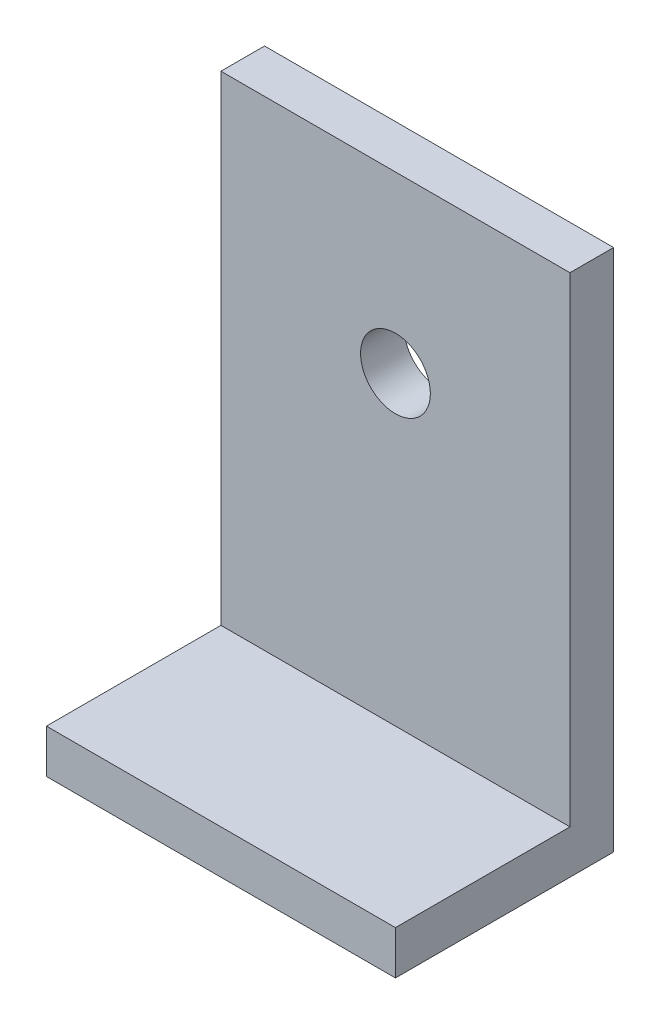
ISO-10303-21;
HEADER;
FILE_DESCRIPTION(('STEP AP214'),'2;1');
FILE_NAME('part.step','',(''),(''),'','','');
FILE_SCHEMA(('AUTOMOTIVE_DESIGN { 1 0 10303 214 1 1 1 1 }'));
ENDSEC;
DATA;
#1=APPLICATION_CONTEXT('core data for automotive mechanical design processes');
#2=APPLICATION_PROTOCOL_DEFINITION('international standard','automotive_design',2000,#1);
#3=PRODUCT_CONTEXT('',#1,'mechanical');
#4=PRODUCT('Part','Part','',(#3));
#5=PRODUCT_RELATED_PRODUCT_CATEGORY('part','',(#4));
#6=PRODUCT_DEFINITION_FORMATION('','',#4);
#7=PRODUCT_DEFINITION_CONTEXT('part definition',#1,'design');
#8=PRODUCT_DEFINITION('design','',#6,#7);
#9=PRODUCT_DEFINITION_SHAPE('','',#8);
#10=(LENGTH_UNIT() NAMED_UNIT(*) SI_UNIT(.MILLI.,.METRE.));
#11=(NAMED_UNIT(*) PLANE_ANGLE_UNIT() SI_UNIT($,.RADIAN.));
#12=(NAMED_UNIT(*) SI_UNIT($,.STERADIAN.) SOLID_ANGLE_UNIT());
#13=UNCERTAINTY_MEASURE_WITH_UNIT(LENGTH_MEASURE(1.E-05),#10,'distance_accuracy_value','');
#14=(GEOMETRIC_REPRESENTATION_CONTEXT(3) GLOBAL_UNCERTAINTY_ASSIGNED_CONTEXT((#13)) GLOBAL_UNIT_ASSIGNED_CONTEXT((#10,
#11,#12)) REPRESENTATION_CONTEXT('',''));
#15=CARTESIAN_POINT('',(0.,0.,0.));
#16=DIRECTION('',(0.,0.,1.));
#17=DIRECTION('',(1.,0.,0.));
#18=AXIS2_PLACEMENT_3D('',#15,#16,#17);
#19=CARTESIAN_POINT('',(40.,0.,5.));
#20=DIRECTION('',(1.,0.,0.));
#21=DIRECTION('',(0.,1.,0.));
#22=AXIS2_PLACEMENT_3D('',#19,#20,#21);
#23=PLANE('',#22);
#24=DIRECTION('',(0.,-1.,0.));
#25=VECTOR('',#24,1.);
#26=CARTESIAN_POINT('',(40.,0.,0.));
#27=LINE('',#26,#25);
#28=CARTESIAN_POINT('',(40.,55.,0.));
#29=VERTEX_POINT('',#28);
#30=CARTESIAN_POINT('',(40.,-4.99999999999999,0.));
#31=VERTEX_POINT('',#30);
#32=EDGE_CURVE('E101',#29,#31,#27,.T.);
#33=ORIENTED_EDGE('',*,*,#32,.F.);
#34=DIRECTION('',(0.,0.,-1.));
#35=VECTOR('',#34,1.);
#36=CARTESIAN_POINT('',(40.,55.,5.));
#37=LINE('',#36,#35);
#38=CARTESIAN_POINT('',(40.,55.,5.));
#39=VERTEX_POINT('',#38);
#40=EDGE_CURVE('E11',#39,#29,#37,.T.);
#41=ORIENTED_EDGE('',*,*,#40,.F.);
#42=DIRECTION('',(0.,-1.,0.));
#43=VECTOR('',#42,1.);
#44=CARTESIAN_POINT('',(40.,0.,5.));
#45=LINE('',#44,#43);
#46=CARTESIAN_POINT('',(40.,0.,5.));
#47=VERTEX_POINT('',#46);
#48=EDGE_CURVE('E79',#39,#47,#45,.T.);
#49=ORIENTED_EDGE('',*,*,#48,.T.);
#50=DIRECTION('',(0.,0.,-1.));
#51=VECTOR('',#50,1.);
#52=CARTESIAN_POINT('',(40.,0.,25.));
#53=LINE('',#52,#51);
#54=CARTESIAN_POINT('',(40.,0.,25.));
#55=VERTEX_POINT('',#54);
#56=EDGE_CURVE('E90',#55,#47,#53,.T.);
#57=ORIENTED_EDGE('',*,*,#56,.F.);
#58=DIRECTION('',(0.,1.,0.));
#59=VECTOR('',#58,1.);
#60=CARTESIAN_POINT('',(40.,0.,25.));
#61=LINE('',#60,#59);
#62=CARTESIAN_POINT('',(40.,-4.99999999999999,25.));
#63=VERTEX_POINT('',#62);
#64=EDGE_CURVE('E134',#63,#55,#61,.T.);
#65=ORIENTED_EDGE('',*,*,#64,.F.);
#66=DIRECTION('',(0.,0.,-1.));
#67=VECTOR('',#66,1.);
#68=CARTESIAN_POINT('',(40.,-4.99999999999999,25.));
#69=LINE('',#68,#67);
#70=EDGE_CURVE('E97',#63,#31,#69,.T.);
#71=ORIENTED_EDGE('',*,*,#70,.T.);
#72=EDGE_LOOP('',(#33,#41,#49,#57,#65,#71));
#73=FACE_BOUND('',#72,.T.);
#74=ADVANCED_FACE('F37',(#73),#23,.T.);
#75=CARTESIAN_POINT('',(0.,55.,5.));
#76=DIRECTION('',(0.,1.,0.));
#77=DIRECTION('',(-1.,0.,0.));
#78=AXIS2_PLACEMENT_3D('',#75,#76,#77);
#79=PLANE('',#78);
#80=DIRECTION('',(1.,0.,0.));
#81=VECTOR('',#80,1.);
#82=CARTESIAN_POINT('',(0.,55.,0.));
#83=LINE('',#82,#81);
#84=CARTESIAN_POINT('',(0.,55.,0.));
#85=VERTEX_POINT('',#84);
#86=EDGE_CURVE('E111',#85,#29,#83,.T.);
#87=ORIENTED_EDGE('',*,*,#86,.F.);
#88=DIRECTION('',(0.,0.,-1.));
#89=VECTOR('',#88,1.);
#90=CARTESIAN_POINT('',(0.,55.,5.));
#91=LINE('',#90,#89);
#92=CARTESIAN_POINT('',(0.,55.,5.));
#93=VERTEX_POINT('',#92);
#94=EDGE_CURVE('E45',#93,#85,#91,.T.);
#95=ORIENTED_EDGE('',*,*,#94,.F.);
#96=DIRECTION('',(1.,0.,0.));
#97=VECTOR('',#96,1.);
#98=CARTESIAN_POINT('',(0.,55.,5.));
#99=LINE('',#98,#97);
#100=EDGE_CURVE('E92',#93,#39,#99,.T.);
#101=ORIENTED_EDGE('',*,*,#100,.T.);
#102=ORIENTED_EDGE('',*,*,#40,.T.);
#103=EDGE_LOOP('',(#87,#95,#101,#102));
#104=FACE_BOUND('',#103,.T.);
#105=ADVANCED_FACE('F120',(#104),#79,.T.);
#106=CARTESIAN_POINT('',(0.,0.,5.));
#107=DIRECTION('',(-1.,0.,0.));
#108=DIRECTION('',(0.,0.,1.));
#109=AXIS2_PLACEMENT_3D('',#106,#107,#108);
#110=PLANE('',#109);
#111=DIRECTION('',(0.,1.,0.));
#112=VECTOR('',#111,1.);
#113=CARTESIAN_POINT('',(0.,0.,0.));
#114=LINE('',#113,#112);
#115=CARTESIAN_POINT('',(0.,-5.00000000000001,0.));
#116=VERTEX_POINT('',#115);
#117=EDGE_CURVE('E84',#116,#85,#114,.T.);
#118=ORIENTED_EDGE('',*,*,#117,.F.);
#119=DIRECTION('',(0.,0.,-1.));
#120=VECTOR('',#119,1.);
#121=CARTESIAN_POINT('',(0.,-5.00000000000001,25.));
#122=LINE('',#121,#120);
#123=CARTESIAN_POINT('',(0.,-5.00000000000001,25.));
#124=VERTEX_POINT('',#123);
#125=EDGE_CURVE('E103',#124,#116,#122,.T.);
#126=ORIENTED_EDGE('',*,*,#125,.F.);
#127=DIRECTION('',(0.,-1.,0.));
#128=VECTOR('',#127,1.);
#129=CARTESIAN_POINT('',(0.,0.,25.));
#130=LINE('',#129,#128);
#131=CARTESIAN_POINT('',(0.,0.,25.));
#132=VERTEX_POINT('',#131);
#133=EDGE_CURVE('E140',#132,#124,#130,.T.);
#134=ORIENTED_EDGE('',*,*,#133,.F.);
#135=DIRECTION('',(0.,0.,-1.));
#136=VECTOR('',#135,1.);
#137=CARTESIAN_POINT('',(0.,0.,25.));
#138=LINE('',#137,#136);
#139=CARTESIAN_POINT('',(0.,0.,5.));
#140=VERTEX_POINT('',#139);
#141=EDGE_CURVE('E98',#132,#140,#138,.T.);
#142=ORIENTED_EDGE('',*,*,#141,.T.);
#143=DIRECTION('',(0.,1.,0.));
#144=VECTOR('',#143,1.);
#145=CARTESIAN_POINT('',(0.,0.,5.));
#146=LINE('',#145,#144);
#147=EDGE_CURVE('E67',#140,#93,#146,.T.);
#148=ORIENTED_EDGE('',*,*,#147,.T.);
#149=ORIENTED_EDGE('',*,*,#94,.T.);
#150=EDGE_LOOP('',(#118,#126,#134,#142,#148,#149));
#151=FACE_BOUND('',#150,.T.);
#152=ADVANCED_FACE('F117',(#151),#110,.T.);
#153=CARTESIAN_POINT('',(0.,0.,5.));
#154=DIRECTION('',(0.,0.,1.));
#155=DIRECTION('',(1.,0.,0.));
#156=AXIS2_PLACEMENT_3D('',#153,#154,#155);
#157=PLANE('',#156);
#158=CARTESIAN_POINT('',(20.,35.,5.));
#159=DIRECTION('',(0.,0.,1.));
#160=DIRECTION('',(1.,0.,0.));
#161=AXIS2_PLACEMENT_3D('',#158,#159,#160);
#162=CIRCLE('',#161,4.);
#163=CARTESIAN_POINT('',(24.,35.,5.));
#164=VERTEX_POINT('',#163);
#165=EDGE_CURVE('E137',#164,#164,#162,.T.);
#166=ORIENTED_EDGE('',*,*,#165,.F.);
#167=EDGE_LOOP('',(#166));
#168=FACE_BOUND('',#167,.T.);
#169=DIRECTION('',(-1.,0.,0.));
#170=VECTOR('',#169,1.);
#171=CARTESIAN_POINT('',(0.,0.,5.));
#172=LINE('',#171,#170);
#173=EDGE_CURVE('E76',#47,#140,#172,.T.);
#174=ORIENTED_EDGE('',*,*,#173,.F.);
#175=ORIENTED_EDGE('',*,*,#48,.F.);
#176=ORIENTED_EDGE('',*,*,#100,.F.);
#177=ORIENTED_EDGE('',*,*,#147,.F.);
#178=EDGE_LOOP('',(#174,#175,#176,#177));
#179=FACE_BOUND('',#178,.T.);
#180=ADVANCED_FACE('F78',(#168,#179),#157,.T.);
#181=CARTESIAN_POINT('',(0.,0.,0.));
#182=DIRECTION('',(0.,0.,1.));
#183=DIRECTION('',(1.,0.,0.));
#184=AXIS2_PLACEMENT_3D('',#181,#182,#183);
#185=PLANE('',#184);
#186=CARTESIAN_POINT('',(20.,35.,0.));
#187=DIRECTION('',(0.,0.,1.));
#188=DIRECTION('',(1.,0.,0.));
#189=AXIS2_PLACEMENT_3D('',#186,#187,#188);
#190=CIRCLE('',#189,4.);
#191=CARTESIAN_POINT('',(24.,35.,0.));
#192=VERTEX_POINT('',#191);
#193=EDGE_CURVE('E131',#192,#192,#190,.T.);
#194=ORIENTED_EDGE('',*,*,#193,.T.);
#195=EDGE_LOOP('',(#194));
#196=FACE_BOUND('',#195,.T.);
#197=ORIENTED_EDGE('',*,*,#32,.T.);
#198=DIRECTION('',(1.,0.,0.));
#199=VECTOR('',#198,1.);
#200=CARTESIAN_POINT('',(0.,-5.00000000000001,0.));
#201=LINE('',#200,#199);
#202=EDGE_CURVE('E125',#116,#31,#201,.T.);
#203=ORIENTED_EDGE('',*,*,#202,.F.);
#204=ORIENTED_EDGE('',*,*,#117,.T.);
#205=ORIENTED_EDGE('',*,*,#86,.T.);
#206=EDGE_LOOP('',(#197,#203,#204,#205));
#207=FACE_BOUND('',#206,.T.);
#208=ADVANCED_FACE('F123',(#196,#207),#185,.F.);
#209=CARTESIAN_POINT('',(0.,0.,25.));
#210=DIRECTION('',(0.,-1.,0.));
#211=DIRECTION('',(0.,0.,-1.));
#212=AXIS2_PLACEMENT_3D('',#209,#210,#211);
#213=PLANE('',#212);
#214=ORIENTED_EDGE('',*,*,#56,.T.);
#215=ORIENTED_EDGE('',*,*,#173,.T.);
#216=ORIENTED_EDGE('',*,*,#141,.F.);
#217=DIRECTION('',(-1.,0.,0.));
#218=VECTOR('',#217,1.);
#219=CARTESIAN_POINT('',(0.,0.,25.));
#220=LINE('',#219,#218);
#221=EDGE_CURVE('E96',#55,#132,#220,.T.);
#222=ORIENTED_EDGE('',*,*,#221,.F.);
#223=EDGE_LOOP('',(#214,#215,#216,#222));
#224=FACE_BOUND('',#223,.T.);
#225=ADVANCED_FACE('F94',(#224),#213,.F.);
#226=CARTESIAN_POINT('',(0.,-5.00000000000001,25.));
#227=DIRECTION('',(0.,1.,0.));
#228=DIRECTION('',(-1.,0.,0.));
#229=AXIS2_PLACEMENT_3D('',#226,#227,#228);
#230=PLANE('',#229);
#231=ORIENTED_EDGE('',*,*,#202,.T.);
#232=ORIENTED_EDGE('',*,*,#70,.F.);
#233=DIRECTION('',(1.,0.,0.));
#234=VECTOR('',#233,1.);
#235=CARTESIAN_POINT('',(0.,-5.00000000000001,25.));
#236=LINE('',#235,#234);
#237=EDGE_CURVE('E130',#124,#63,#236,.T.);
#238=ORIENTED_EDGE('',*,*,#237,.F.);
#239=ORIENTED_EDGE('',*,*,#125,.T.);
#240=EDGE_LOOP('',(#231,#232,#238,#239));
#241=FACE_BOUND('',#240,.T.);
#242=ADVANCED_FACE('F186',(#241),#230,.F.);
#243=CARTESIAN_POINT('',(0.,0.,25.));
#244=DIRECTION('',(0.,0.,1.));
#245=DIRECTION('',(1.,0.,0.));
#246=AXIS2_PLACEMENT_3D('',#243,#244,#245);
#247=PLANE('',#246);
#248=ORIENTED_EDGE('',*,*,#237,.T.);
#249=ORIENTED_EDGE('',*,*,#64,.T.);
#250=ORIENTED_EDGE('',*,*,#221,.T.);
#251=ORIENTED_EDGE('',*,*,#133,.T.);
#252=EDGE_LOOP('',(#248,#249,#250,#251));
#253=FACE_BOUND('',#252,.T.);
#254=ADVANCED_FACE('F195',(#253),#247,.T.);
#255=CARTESIAN_POINT('',(20.,35.,0.));
#256=DIRECTION('',(0.,0.,1.));
#257=DIRECTION('',(1.,0.,0.));
#258=AXIS2_PLACEMENT_3D('',#255,#256,#257);
#259=CYLINDRICAL_SURFACE('',#258,4.);
#260=ORIENTED_EDGE('',*,*,#193,.F.);
#261=EDGE_LOOP('',(#260));
#262=FACE_BOUND('',#261,.T.);
#263=ORIENTED_EDGE('',*,*,#165,.T.);
#264=EDGE_LOOP('',(#263));
#265=FACE_BOUND('',#264,.T.);
#266=ADVANCED_FACE('F151',(#262,#265),#259,.F.);
#267=CLOSED_SHELL('',(#74,#105,#152,#180,#208,#225,#242,#254,#266));
#268=MANIFOLD_SOLID_BREP('B2',#267);
#269=ADVANCED_BREP_SHAPE_REPRESENTATION('',(#18,#268),#14);
#270=SHAPE_DEFINITION_REPRESENTATION(#9,#269);
ENDSEC;
END-ISO-10303-21;
